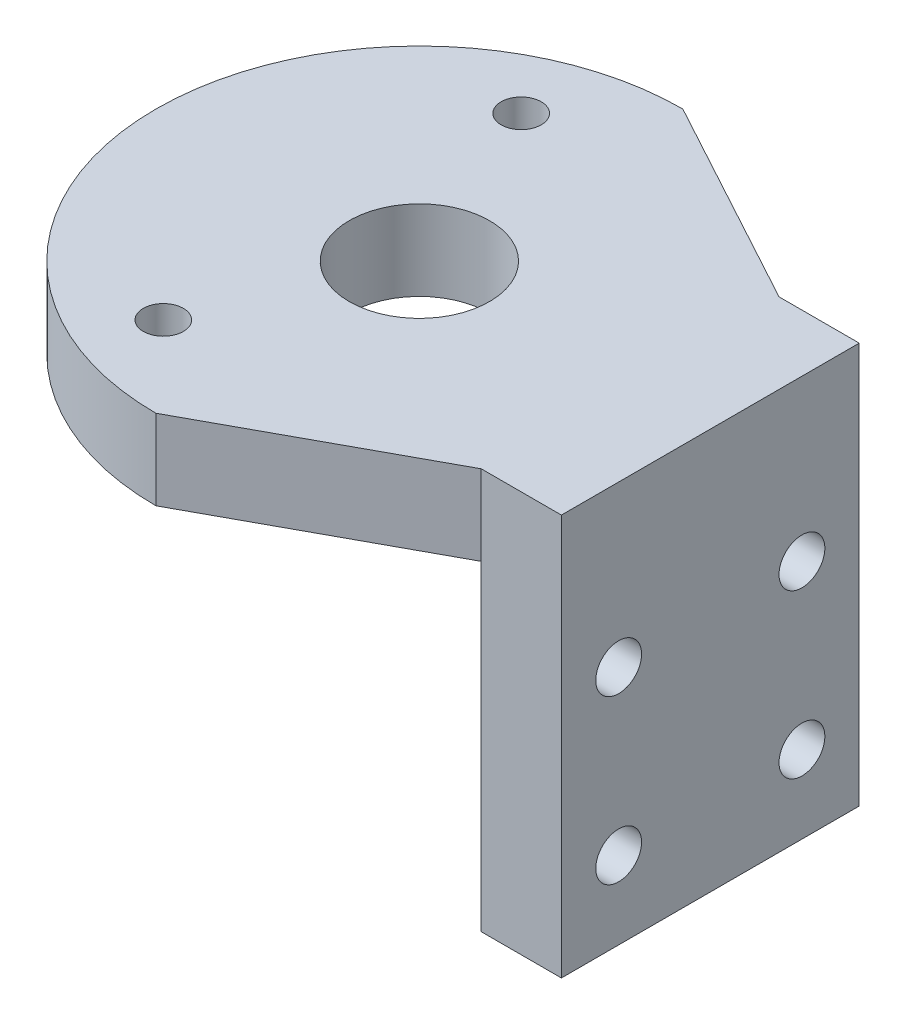
ISO-10303-21;
HEADER;
FILE_DESCRIPTION(('STEP AP214'),'2;1');
FILE_NAME('part.step','',(''),(''),'','','');
FILE_SCHEMA(('AUTOMOTIVE_DESIGN { 1 0 10303 214 1 1 1 1 }'));
ENDSEC;
DATA;
#1=APPLICATION_CONTEXT('core data for automotive mechanical design processes');
#2=APPLICATION_PROTOCOL_DEFINITION('international standard','automotive_design',2000,#1);
#3=PRODUCT_CONTEXT('',#1,'mechanical');
#4=PRODUCT('Part','Part','',(#3));
#5=PRODUCT_RELATED_PRODUCT_CATEGORY('part','',(#4));
#6=PRODUCT_DEFINITION_FORMATION('','',#4);
#7=PRODUCT_DEFINITION_CONTEXT('part definition',#1,'design');
#8=PRODUCT_DEFINITION('design','',#6,#7);
#9=PRODUCT_DEFINITION_SHAPE('','',#8);
#10=(LENGTH_UNIT() NAMED_UNIT(*) SI_UNIT(.MILLI.,.METRE.));
#11=(NAMED_UNIT(*) PLANE_ANGLE_UNIT() SI_UNIT($,.RADIAN.));
#12=(NAMED_UNIT(*) SI_UNIT($,.STERADIAN.) SOLID_ANGLE_UNIT());
#13=UNCERTAINTY_MEASURE_WITH_UNIT(LENGTH_MEASURE(1.E-05),#10,'distance_accuracy_value','');
#14=(GEOMETRIC_REPRESENTATION_CONTEXT(3) GLOBAL_UNCERTAINTY_ASSIGNED_CONTEXT((#13)) GLOBAL_UNIT_ASSIGNED_CONTEXT((#10,
#11,#12)) REPRESENTATION_CONTEXT('',''));
#15=CARTESIAN_POINT('',(0.,0.,0.));
#16=DIRECTION('',(0.,0.,1.));
#17=DIRECTION('',(1.,0.,0.));
#18=AXIS2_PLACEMENT_3D('',#15,#16,#17);
#19=CARTESIAN_POINT('',(0.,-7.,0.));
#20=DIRECTION('',(0.,1.,0.));
#21=DIRECTION('',(0.,0.,1.));
#22=AXIS2_PLACEMENT_3D('',#19,#20,#21);
#23=PLANE('',#22);
#24=CARTESIAN_POINT('',(-6.731,-7.,-15.621));
#25=DIRECTION('',(0.,1.,0.));
#26=DIRECTION('',(0.,0.,1.));
#27=AXIS2_PLACEMENT_3D('',#24,#25,#26);
#28=CIRCLE('',#27,1.75);
#29=CARTESIAN_POINT('',(-6.731,-7.,-13.871));
#30=VERTEX_POINT('',#29);
#31=EDGE_CURVE('E189',#30,#30,#28,.T.);
#32=ORIENTED_EDGE('',*,*,#31,.T.);
#33=EDGE_LOOP('',(#32));
#34=FACE_BOUND('',#33,.T.);
#35=CARTESIAN_POINT('',(-6.731,-7.,15.621));
#36=DIRECTION('',(0.,1.,0.));
#37=DIRECTION('',(0.,0.,1.));
#38=AXIS2_PLACEMENT_3D('',#35,#36,#37);
#39=CIRCLE('',#38,1.75);
#40=CARTESIAN_POINT('',(-6.731,-7.,17.371));
#41=VERTEX_POINT('',#40);
#42=EDGE_CURVE('E185',#41,#41,#39,.T.);
#43=ORIENTED_EDGE('',*,*,#42,.T.);
#44=EDGE_LOOP('',(#43));
#45=FACE_BOUND('',#44,.T.);
#46=CARTESIAN_POINT('',(0.,-7.,0.));
#47=DIRECTION('',(0.,1.,0.));
#48=DIRECTION('',(0.,0.,1.));
#49=AXIS2_PLACEMENT_3D('',#46,#47,#48);
#50=CIRCLE('',#49,6.125);
#51=CARTESIAN_POINT('',(0.,-7.,6.125));
#52=VERTEX_POINT('',#51);
#53=EDGE_CURVE('E130',#52,#52,#50,.T.);
#54=ORIENTED_EDGE('',*,*,#53,.T.);
#55=EDGE_LOOP('',(#54));
#56=FACE_BOUND('',#55,.T.);
#57=CARTESIAN_POINT('',(0.,-7.,0.));
#58=DIRECTION('',(0.,1.,0.));
#59=DIRECTION('',(0.,0.,1.));
#60=AXIS2_PLACEMENT_3D('',#57,#58,#59);
#61=CIRCLE('',#60,23.);
#62=CARTESIAN_POINT('',(0.,-7.,-23.));
#63=VERTEX_POINT('',#62);
#64=CARTESIAN_POINT('',(0.,-7.,23.));
#65=VERTEX_POINT('',#64);
#66=EDGE_CURVE('E115',#63,#65,#61,.T.);
#67=ORIENTED_EDGE('',*,*,#66,.F.);
#68=DIRECTION('',(-0.878624509572547,0.,-0.477513320419862));
#69=VECTOR('',#68,1.);
#70=CARTESIAN_POINT('',(0.,-7.,-23.));
#71=LINE('',#70,#69);
#72=CARTESIAN_POINT('',(18.4,-7.,-13.));
#73=VERTEX_POINT('',#72);
#74=EDGE_CURVE('E100',#73,#63,#71,.T.);
#75=ORIENTED_EDGE('',*,*,#74,.F.);
#76=DIRECTION('',(0.,0.,-1.));
#77=VECTOR('',#76,1.);
#78=CARTESIAN_POINT('',(18.4,-7.,23.));
#79=LINE('',#78,#77);
#80=CARTESIAN_POINT('',(18.4,-7.,13.));
#81=VERTEX_POINT('',#80);
#82=EDGE_CURVE('E113',#81,#73,#79,.T.);
#83=ORIENTED_EDGE('',*,*,#82,.F.);
#84=DIRECTION('',(0.878624509572547,0.,-0.477513320419862));
#85=VECTOR('',#84,1.);
#86=CARTESIAN_POINT('',(0.,-7.,23.));
#87=LINE('',#86,#85);
#88=EDGE_CURVE('E307',#65,#81,#87,.T.);
#89=ORIENTED_EDGE('',*,*,#88,.F.);
#90=EDGE_LOOP('',(#67,#75,#83,#89));
#91=FACE_BOUND('',#90,.T.);
#92=ADVANCED_FACE('F38',(#34,#45,#56,#91),#23,.F.);
#93=CARTESIAN_POINT('',(0.,-7.,0.));
#94=DIRECTION('',(0.,1.,0.));
#95=DIRECTION('',(0.,0.,1.));
#96=AXIS2_PLACEMENT_3D('',#93,#94,#95);
#97=CYLINDRICAL_SURFACE('',#96,23.);
#98=CARTESIAN_POINT('',(0.,0.,0.));
#99=DIRECTION('',(0.,1.,0.));
#100=DIRECTION('',(0.,0.,1.));
#101=AXIS2_PLACEMENT_3D('',#98,#99,#100);
#102=CIRCLE('',#101,23.);
#103=CARTESIAN_POINT('',(0.,0.,-23.));
#104=VERTEX_POINT('',#103);
#105=CARTESIAN_POINT('',(0.,0.,23.));
#106=VERTEX_POINT('',#105);
#107=EDGE_CURVE('E145',#104,#106,#102,.T.);
#108=ORIENTED_EDGE('',*,*,#107,.F.);
#109=DIRECTION('',(0.,1.,0.));
#110=VECTOR('',#109,1.);
#111=CARTESIAN_POINT('',(0.,-7.,-23.));
#112=LINE('',#111,#110);
#113=EDGE_CURVE('E152',#63,#104,#112,.T.);
#114=ORIENTED_EDGE('',*,*,#113,.F.);
#115=ORIENTED_EDGE('',*,*,#66,.T.);
#116=DIRECTION('',(0.,1.,0.));
#117=VECTOR('',#116,1.);
#118=CARTESIAN_POINT('',(0.,-7.,23.));
#119=LINE('',#118,#117);
#120=EDGE_CURVE('E143',#65,#106,#119,.T.);
#121=ORIENTED_EDGE('',*,*,#120,.T.);
#122=EDGE_LOOP('',(#108,#114,#115,#121));
#123=FACE_BOUND('',#122,.T.);
#124=ADVANCED_FACE('F40',(#123),#97,.T.);
#125=CARTESIAN_POINT('',(25.4,-7.,-23.));
#126=DIRECTION('',(1.,0.,0.));
#127=DIRECTION('',(0.,0.,-1.));
#128=AXIS2_PLACEMENT_3D('',#125,#126,#127);
#129=PLANE('',#128);
#130=CARTESIAN_POINT('',(25.4,-14.,8.00000000000001));
#131=DIRECTION('',(1.,0.,0.));
#132=DIRECTION('',(0.,0.,-1.));
#133=AXIS2_PLACEMENT_3D('',#130,#131,#132);
#134=CIRCLE('',#133,2.);
#135=CARTESIAN_POINT('',(25.4,-14.,6.00000000000001));
#136=VERTEX_POINT('',#135);
#137=EDGE_CURVE('E304',#136,#136,#134,.T.);
#138=ORIENTED_EDGE('',*,*,#137,.F.);
#139=EDGE_LOOP('',(#138));
#140=FACE_BOUND('',#139,.T.);
#141=CARTESIAN_POINT('',(25.4,-28.225,-7.99999999999999));
#142=DIRECTION('',(1.,0.,0.));
#143=DIRECTION('',(0.,0.,-1.));
#144=AXIS2_PLACEMENT_3D('',#141,#142,#143);
#145=CIRCLE('',#144,2.);
#146=CARTESIAN_POINT('',(25.4,-28.225,-9.99999999999999));
#147=VERTEX_POINT('',#146);
#148=EDGE_CURVE('E300',#147,#147,#145,.T.);
#149=ORIENTED_EDGE('',*,*,#148,.F.);
#150=EDGE_LOOP('',(#149));
#151=FACE_BOUND('',#150,.T.);
#152=CARTESIAN_POINT('',(25.4,-28.225,8.00000000000001));
#153=DIRECTION('',(1.,0.,0.));
#154=DIRECTION('',(0.,0.,-1.));
#155=AXIS2_PLACEMENT_3D('',#152,#153,#154);
#156=CIRCLE('',#155,2.);
#157=CARTESIAN_POINT('',(25.4,-28.225,6.00000000000001));
#158=VERTEX_POINT('',#157);
#159=EDGE_CURVE('E274',#158,#158,#156,.T.);
#160=ORIENTED_EDGE('',*,*,#159,.F.);
#161=EDGE_LOOP('',(#160));
#162=FACE_BOUND('',#161,.T.);
#163=CARTESIAN_POINT('',(25.4,-14.,-7.99999999999999));
#164=DIRECTION('',(1.,0.,0.));
#165=DIRECTION('',(0.,0.,-1.));
#166=AXIS2_PLACEMENT_3D('',#163,#164,#165);
#167=CIRCLE('',#166,2.);
#168=CARTESIAN_POINT('',(25.4,-14.,-9.99999999999999));
#169=VERTEX_POINT('',#168);
#170=EDGE_CURVE('E294',#169,#169,#167,.T.);
#171=ORIENTED_EDGE('',*,*,#170,.F.);
#172=EDGE_LOOP('',(#171));
#173=FACE_BOUND('',#172,.T.);
#174=DIRECTION('',(0.,-1.,0.));
#175=VECTOR('',#174,1.);
#176=CARTESIAN_POINT('',(25.4,-7.,-13.));
#177=LINE('',#176,#175);
#178=CARTESIAN_POINT('',(25.4,0.,-13.));
#179=VERTEX_POINT('',#178);
#180=CARTESIAN_POINT('',(25.4,-35.,-13.));
#181=VERTEX_POINT('',#180);
#182=EDGE_CURVE('E54',#179,#181,#177,.T.);
#183=ORIENTED_EDGE('',*,*,#182,.F.);
#184=DIRECTION('',(0.,0.,-1.));
#185=VECTOR('',#184,1.);
#186=CARTESIAN_POINT('',(25.4,0.,-23.));
#187=LINE('',#186,#185);
#188=CARTESIAN_POINT('',(25.4,0.,13.));
#189=VERTEX_POINT('',#188);
#190=EDGE_CURVE('E144',#189,#179,#187,.T.);
#191=ORIENTED_EDGE('',*,*,#190,.F.);
#192=DIRECTION('',(0.,1.,0.));
#193=VECTOR('',#192,1.);
#194=CARTESIAN_POINT('',(25.4,-7.,13.));
#195=LINE('',#194,#193);
#196=CARTESIAN_POINT('',(25.4,-35.,13.));
#197=VERTEX_POINT('',#196);
#198=EDGE_CURVE('E179',#197,#189,#195,.T.);
#199=ORIENTED_EDGE('',*,*,#198,.F.);
#200=DIRECTION('',(0.,0.,1.));
#201=VECTOR('',#200,1.);
#202=CARTESIAN_POINT('',(25.4,-35.,23.));
#203=LINE('',#202,#201);
#204=EDGE_CURVE('E134',#181,#197,#203,.T.);
#205=ORIENTED_EDGE('',*,*,#204,.F.);
#206=EDGE_LOOP('',(#183,#191,#199,#205));
#207=FACE_BOUND('',#206,.T.);
#208=ADVANCED_FACE('F177',(#140,#151,#162,#173,#207),#129,.T.);
#209=CARTESIAN_POINT('',(0.,0.,0.));
#210=DIRECTION('',(0.,1.,0.));
#211=DIRECTION('',(0.,0.,1.));
#212=AXIS2_PLACEMENT_3D('',#209,#210,#211);
#213=PLANE('',#212);
#214=DIRECTION('',(0.878624509572547,0.,0.477513320419862));
#215=VECTOR('',#214,1.);
#216=CARTESIAN_POINT('',(9.64976286026997,0.,-17.7555636628968));
#217=LINE('',#216,#215);
#218=CARTESIAN_POINT('',(18.4,0.,-13.));
#219=VERTEX_POINT('',#218);
#220=EDGE_CURVE('E11',#104,#219,#217,.T.);
#221=ORIENTED_EDGE('',*,*,#220,.F.);
#222=ORIENTED_EDGE('',*,*,#107,.T.);
#223=DIRECTION('',(-0.878624509572547,0.,0.477513320419862));
#224=VECTOR('',#223,1.);
#225=CARTESIAN_POINT('',(9.64976286026997,0.,17.7555636628968));
#226=LINE('',#225,#224);
#227=CARTESIAN_POINT('',(18.4,0.,13.));
#228=VERTEX_POINT('',#227);
#229=EDGE_CURVE('E163',#228,#106,#226,.T.);
#230=ORIENTED_EDGE('',*,*,#229,.F.);
#231=DIRECTION('',(-1.,0.,0.));
#232=VECTOR('',#231,1.);
#233=CARTESIAN_POINT('',(0.,0.,13.));
#234=LINE('',#233,#232);
#235=EDGE_CURVE('E166',#189,#228,#234,.T.);
#236=ORIENTED_EDGE('',*,*,#235,.F.);
#237=ORIENTED_EDGE('',*,*,#190,.T.);
#238=DIRECTION('',(1.,0.,0.));
#239=VECTOR('',#238,1.);
#240=CARTESIAN_POINT('',(0.,0.,-13.));
#241=LINE('',#240,#239);
#242=EDGE_CURVE('E47',#219,#179,#241,.T.);
#243=ORIENTED_EDGE('',*,*,#242,.F.);
#244=EDGE_LOOP('',(#221,#222,#230,#236,#237,#243));
#245=FACE_BOUND('',#244,.T.);
#246=CARTESIAN_POINT('',(-6.731,0.,-15.621));
#247=DIRECTION('',(0.,1.,0.));
#248=DIRECTION('',(0.,0.,1.));
#249=AXIS2_PLACEMENT_3D('',#246,#247,#248);
#250=CIRCLE('',#249,1.75);
#251=CARTESIAN_POINT('',(-6.731,0.,-13.871));
#252=VERTEX_POINT('',#251);
#253=EDGE_CURVE('E193',#252,#252,#250,.T.);
#254=ORIENTED_EDGE('',*,*,#253,.F.);
#255=EDGE_LOOP('',(#254));
#256=FACE_BOUND('',#255,.T.);
#257=CARTESIAN_POINT('',(-6.731,0.,15.621));
#258=DIRECTION('',(0.,1.,0.));
#259=DIRECTION('',(0.,0.,1.));
#260=AXIS2_PLACEMENT_3D('',#257,#258,#259);
#261=CIRCLE('',#260,1.75);
#262=CARTESIAN_POINT('',(-6.731,0.,17.371));
#263=VERTEX_POINT('',#262);
#264=EDGE_CURVE('E197',#263,#263,#261,.T.);
#265=ORIENTED_EDGE('',*,*,#264,.F.);
#266=EDGE_LOOP('',(#265));
#267=FACE_BOUND('',#266,.T.);
#268=CARTESIAN_POINT('',(0.,0.,0.));
#269=DIRECTION('',(0.,1.,0.));
#270=DIRECTION('',(0.,0.,1.));
#271=AXIS2_PLACEMENT_3D('',#268,#269,#270);
#272=CIRCLE('',#271,6.125);
#273=CARTESIAN_POINT('',(0.,0.,6.125));
#274=VERTEX_POINT('',#273);
#275=EDGE_CURVE('E137',#274,#274,#272,.T.);
#276=ORIENTED_EDGE('',*,*,#275,.F.);
#277=EDGE_LOOP('',(#276));
#278=FACE_BOUND('',#277,.T.);
#279=ADVANCED_FACE('F172',(#245,#256,#267,#278),#213,.T.);
#280=CARTESIAN_POINT('',(18.4,-35.,23.));
#281=DIRECTION('',(1.,0.,0.));
#282=DIRECTION('',(0.,0.,-1.));
#283=AXIS2_PLACEMENT_3D('',#280,#281,#282);
#284=PLANE('',#283);
#285=CARTESIAN_POINT('',(18.4,-14.,8.));
#286=DIRECTION('',(-1.,0.,0.));
#287=DIRECTION('',(0.,0.,1.));
#288=AXIS2_PLACEMENT_3D('',#285,#286,#287);
#289=CIRCLE('',#288,2.);
#290=CARTESIAN_POINT('',(18.4,-14.,10.));
#291=VERTEX_POINT('',#290);
#292=EDGE_CURVE('E284',#291,#291,#289,.T.);
#293=ORIENTED_EDGE('',*,*,#292,.F.);
#294=EDGE_LOOP('',(#293));
#295=FACE_BOUND('',#294,.T.);
#296=CARTESIAN_POINT('',(18.4,-28.225,-7.99999999999999));
#297=DIRECTION('',(-1.,0.,0.));
#298=DIRECTION('',(0.,0.,1.));
#299=AXIS2_PLACEMENT_3D('',#296,#297,#298);
#300=CIRCLE('',#299,2.);
#301=CARTESIAN_POINT('',(18.4,-28.225,-5.99999999999999));
#302=VERTEX_POINT('',#301);
#303=EDGE_CURVE('E280',#302,#302,#300,.T.);
#304=ORIENTED_EDGE('',*,*,#303,.F.);
#305=EDGE_LOOP('',(#304));
#306=FACE_BOUND('',#305,.T.);
#307=CARTESIAN_POINT('',(18.4,-28.225,8.00000000000001));
#308=DIRECTION('',(-1.,0.,0.));
#309=DIRECTION('',(0.,0.,1.));
#310=AXIS2_PLACEMENT_3D('',#307,#308,#309);
#311=CIRCLE('',#310,2.);
#312=CARTESIAN_POINT('',(18.4,-28.225,10.));
#313=VERTEX_POINT('',#312);
#314=EDGE_CURVE('E277',#313,#313,#311,.T.);
#315=ORIENTED_EDGE('',*,*,#314,.F.);
#316=EDGE_LOOP('',(#315));
#317=FACE_BOUND('',#316,.T.);
#318=CARTESIAN_POINT('',(18.4,-14.,-8.));
#319=DIRECTION('',(-1.,0.,0.));
#320=DIRECTION('',(0.,0.,1.));
#321=AXIS2_PLACEMENT_3D('',#318,#319,#320);
#322=CIRCLE('',#321,2.);
#323=CARTESIAN_POINT('',(18.4,-14.,-6.));
#324=VERTEX_POINT('',#323);
#325=EDGE_CURVE('E289',#324,#324,#322,.T.);
#326=ORIENTED_EDGE('',*,*,#325,.F.);
#327=EDGE_LOOP('',(#326));
#328=FACE_BOUND('',#327,.T.);
#329=DIRECTION('',(0.,0.,-1.));
#330=VECTOR('',#329,1.);
#331=CARTESIAN_POINT('',(18.4,-35.,23.));
#332=LINE('',#331,#330);
#333=CARTESIAN_POINT('',(18.4,-35.,13.));
#334=VERTEX_POINT('',#333);
#335=CARTESIAN_POINT('',(18.4,-35.,-13.));
#336=VERTEX_POINT('',#335);
#337=EDGE_CURVE('E129',#334,#336,#332,.T.);
#338=ORIENTED_EDGE('',*,*,#337,.F.);
#339=DIRECTION('',(0.,-1.,0.));
#340=VECTOR('',#339,1.);
#341=CARTESIAN_POINT('',(18.4,-7.,13.));
#342=LINE('',#341,#340);
#343=EDGE_CURVE('E62',#81,#334,#342,.T.);
#344=ORIENTED_EDGE('',*,*,#343,.F.);
#345=ORIENTED_EDGE('',*,*,#82,.T.);
#346=DIRECTION('',(0.,1.,0.));
#347=VECTOR('',#346,1.);
#348=CARTESIAN_POINT('',(18.4,-7.,-13.));
#349=LINE('',#348,#347);
#350=EDGE_CURVE('E106',#336,#73,#349,.T.);
#351=ORIENTED_EDGE('',*,*,#350,.F.);
#352=EDGE_LOOP('',(#338,#344,#345,#351));
#353=FACE_BOUND('',#352,.T.);
#354=ADVANCED_FACE('F127',(#295,#306,#317,#328,#353),#284,.F.);
#355=CARTESIAN_POINT('',(0.,-35.,0.));
#356=DIRECTION('',(0.,1.,0.));
#357=DIRECTION('',(0.,0.,1.));
#358=AXIS2_PLACEMENT_3D('',#355,#356,#357);
#359=PLANE('',#358);
#360=ORIENTED_EDGE('',*,*,#204,.T.);
#361=DIRECTION('',(-1.,0.,0.));
#362=VECTOR('',#361,1.);
#363=CARTESIAN_POINT('',(0.,-35.,13.));
#364=LINE('',#363,#362);
#365=EDGE_CURVE('E160',#197,#334,#364,.T.);
#366=ORIENTED_EDGE('',*,*,#365,.T.);
#367=ORIENTED_EDGE('',*,*,#337,.T.);
#368=DIRECTION('',(1.,0.,0.));
#369=VECTOR('',#368,1.);
#370=CARTESIAN_POINT('',(0.,-35.,-13.));
#371=LINE('',#370,#369);
#372=EDGE_CURVE('E121',#336,#181,#371,.T.);
#373=ORIENTED_EDGE('',*,*,#372,.T.);
#374=EDGE_LOOP('',(#360,#366,#367,#373));
#375=FACE_BOUND('',#374,.T.);
#376=ADVANCED_FACE('F216',(#375),#359,.F.);
#377=CARTESIAN_POINT('',(0.,-7.,0.));
#378=DIRECTION('',(0.,1.,0.));
#379=DIRECTION('',(0.,0.,1.));
#380=AXIS2_PLACEMENT_3D('',#377,#378,#379);
#381=CYLINDRICAL_SURFACE('',#380,6.125);
#382=ORIENTED_EDGE('',*,*,#53,.F.);
#383=EDGE_LOOP('',(#382));
#384=FACE_BOUND('',#383,.T.);
#385=ORIENTED_EDGE('',*,*,#275,.T.);
#386=EDGE_LOOP('',(#385));
#387=FACE_BOUND('',#386,.T.);
#388=ADVANCED_FACE('F208',(#384,#387),#381,.F.);
#389=CARTESIAN_POINT('',(-6.731,-7.,15.621));
#390=DIRECTION('',(0.,1.,0.));
#391=DIRECTION('',(0.,0.,1.));
#392=AXIS2_PLACEMENT_3D('',#389,#390,#391);
#393=CYLINDRICAL_SURFACE('',#392,1.75);
#394=ORIENTED_EDGE('',*,*,#42,.F.);
#395=EDGE_LOOP('',(#394));
#396=FACE_BOUND('',#395,.T.);
#397=ORIENTED_EDGE('',*,*,#264,.T.);
#398=EDGE_LOOP('',(#397));
#399=FACE_BOUND('',#398,.T.);
#400=ADVANCED_FACE('F234',(#396,#399),#393,.F.);
#401=CARTESIAN_POINT('',(-6.731,-7.,-15.621));
#402=DIRECTION('',(0.,1.,0.));
#403=DIRECTION('',(0.,0.,1.));
#404=AXIS2_PLACEMENT_3D('',#401,#402,#403);
#405=CYLINDRICAL_SURFACE('',#404,1.75);
#406=ORIENTED_EDGE('',*,*,#31,.F.);
#407=EDGE_LOOP('',(#406));
#408=FACE_BOUND('',#407,.T.);
#409=ORIENTED_EDGE('',*,*,#253,.T.);
#410=EDGE_LOOP('',(#409));
#411=FACE_BOUND('',#410,.T.);
#412=ADVANCED_FACE('F238',(#408,#411),#405,.F.);
#413=CARTESIAN_POINT('',(28.4,-7.,-13.));
#414=DIRECTION('',(0.,0.,1.));
#415=DIRECTION('',(1.,0.,0.));
#416=AXIS2_PLACEMENT_3D('',#413,#414,#415);
#417=PLANE('',#416);
#418=ORIENTED_EDGE('',*,*,#182,.T.);
#419=ORIENTED_EDGE('',*,*,#372,.F.);
#420=ORIENTED_EDGE('',*,*,#350,.T.);
#421=DIRECTION('',(0.,-1.,0.));
#422=VECTOR('',#421,1.);
#423=CARTESIAN_POINT('',(18.4,3.,-13.));
#424=LINE('',#423,#422);
#425=EDGE_CURVE('E97',#219,#73,#424,.T.);
#426=ORIENTED_EDGE('',*,*,#425,.F.);
#427=ORIENTED_EDGE('',*,*,#242,.T.);
#428=EDGE_LOOP('',(#418,#419,#420,#426,#427));
#429=FACE_BOUND('',#428,.T.);
#430=ADVANCED_FACE('F120',(#429),#417,.F.);
#431=CARTESIAN_POINT('',(28.4,-7.,13.));
#432=DIRECTION('',(0.,0.,-1.));
#433=DIRECTION('',(-1.,0.,0.));
#434=AXIS2_PLACEMENT_3D('',#431,#432,#433);
#435=PLANE('',#434);
#436=ORIENTED_EDGE('',*,*,#198,.T.);
#437=ORIENTED_EDGE('',*,*,#235,.T.);
#438=DIRECTION('',(0.,-1.,0.));
#439=VECTOR('',#438,1.);
#440=CARTESIAN_POINT('',(18.4,3.,13.));
#441=LINE('',#440,#439);
#442=EDGE_CURVE('E117',#228,#81,#441,.T.);
#443=ORIENTED_EDGE('',*,*,#442,.T.);
#444=ORIENTED_EDGE('',*,*,#343,.T.);
#445=ORIENTED_EDGE('',*,*,#365,.F.);
#446=EDGE_LOOP('',(#436,#437,#443,#444,#445));
#447=FACE_BOUND('',#446,.T.);
#448=ADVANCED_FACE('F245',(#447),#435,.F.);
#449=CARTESIAN_POINT('',(0.,3.,23.));
#450=DIRECTION('',(-0.477513320419862,0.,-0.878624509572547));
#451=DIRECTION('',(-0.878624509572547,0.,0.477513320419862));
#452=AXIS2_PLACEMENT_3D('',#449,#450,#451);
#453=PLANE('',#452);
#454=ORIENTED_EDGE('',*,*,#229,.T.);
#455=ORIENTED_EDGE('',*,*,#120,.F.);
#456=ORIENTED_EDGE('',*,*,#88,.T.);
#457=ORIENTED_EDGE('',*,*,#442,.F.);
#458=EDGE_LOOP('',(#454,#455,#456,#457));
#459=FACE_BOUND('',#458,.T.);
#460=ADVANCED_FACE('F248',(#459),#453,.F.);
#461=CARTESIAN_POINT('',(0.,3.,-23.));
#462=DIRECTION('',(-0.477513320419862,0.,0.878624509572547));
#463=DIRECTION('',(0.878624509572547,0.,0.477513320419862));
#464=AXIS2_PLACEMENT_3D('',#461,#462,#463);
#465=PLANE('',#464);
#466=ORIENTED_EDGE('',*,*,#220,.T.);
#467=ORIENTED_EDGE('',*,*,#425,.T.);
#468=ORIENTED_EDGE('',*,*,#74,.T.);
#469=ORIENTED_EDGE('',*,*,#113,.T.);
#470=EDGE_LOOP('',(#466,#467,#468,#469));
#471=FACE_BOUND('',#470,.T.);
#472=ADVANCED_FACE('F99',(#471),#465,.F.);
#473=CARTESIAN_POINT('',(28.4,-14.,-7.99999999999999));
#474=DIRECTION('',(-1.,0.,0.));
#475=DIRECTION('',(0.,0.,1.));
#476=AXIS2_PLACEMENT_3D('',#473,#474,#475);
#477=CYLINDRICAL_SURFACE('',#476,2.);
#478=ORIENTED_EDGE('',*,*,#170,.T.);
#479=EDGE_LOOP('',(#478));
#480=FACE_BOUND('',#479,.T.);
#481=ORIENTED_EDGE('',*,*,#325,.T.);
#482=EDGE_LOOP('',(#481));
#483=FACE_BOUND('',#482,.T.);
#484=ADVANCED_FACE('F254',(#480,#483),#477,.F.);
#485=CARTESIAN_POINT('',(28.4,-28.225,8.00000000000001));
#486=DIRECTION('',(-1.,0.,0.));
#487=DIRECTION('',(0.,0.,1.));
#488=AXIS2_PLACEMENT_3D('',#485,#486,#487);
#489=CYLINDRICAL_SURFACE('',#488,2.);
#490=ORIENTED_EDGE('',*,*,#159,.T.);
#491=EDGE_LOOP('',(#490));
#492=FACE_BOUND('',#491,.T.);
#493=ORIENTED_EDGE('',*,*,#314,.T.);
#494=EDGE_LOOP('',(#493));
#495=FACE_BOUND('',#494,.T.);
#496=ADVANCED_FACE('F257',(#492,#495),#489,.F.);
#497=CARTESIAN_POINT('',(28.4,-28.225,-7.99999999999999));
#498=DIRECTION('',(-1.,0.,0.));
#499=DIRECTION('',(0.,0.,1.));
#500=AXIS2_PLACEMENT_3D('',#497,#498,#499);
#501=CYLINDRICAL_SURFACE('',#500,2.);
#502=ORIENTED_EDGE('',*,*,#148,.T.);
#503=EDGE_LOOP('',(#502));
#504=FACE_BOUND('',#503,.T.);
#505=ORIENTED_EDGE('',*,*,#303,.T.);
#506=EDGE_LOOP('',(#505));
#507=FACE_BOUND('',#506,.T.);
#508=ADVANCED_FACE('F259',(#504,#507),#501,.F.);
#509=CARTESIAN_POINT('',(28.4,-14.,8.00000000000001));
#510=DIRECTION('',(-1.,0.,0.));
#511=DIRECTION('',(0.,0.,1.));
#512=AXIS2_PLACEMENT_3D('',#509,#510,#511);
#513=CYLINDRICAL_SURFACE('',#512,2.);
#514=ORIENTED_EDGE('',*,*,#137,.T.);
#515=EDGE_LOOP('',(#514));
#516=FACE_BOUND('',#515,.T.);
#517=ORIENTED_EDGE('',*,*,#292,.T.);
#518=EDGE_LOOP('',(#517));
#519=FACE_BOUND('',#518,.T.);
#520=ADVANCED_FACE('F262',(#516,#519),#513,.F.);
#521=CLOSED_SHELL('',(#92,#124,#208,#279,#354,#376,#388,#400,#412,#430,#448,#460,#472,#484,#496,
#508,#520));
#522=MANIFOLD_SOLID_BREP('B2',#521);
#523=ADVANCED_BREP_SHAPE_REPRESENTATION('',(#18,#522),#14);
#524=SHAPE_DEFINITION_REPRESENTATION(#9,#523);
ENDSEC;
END-ISO-10303-21;
